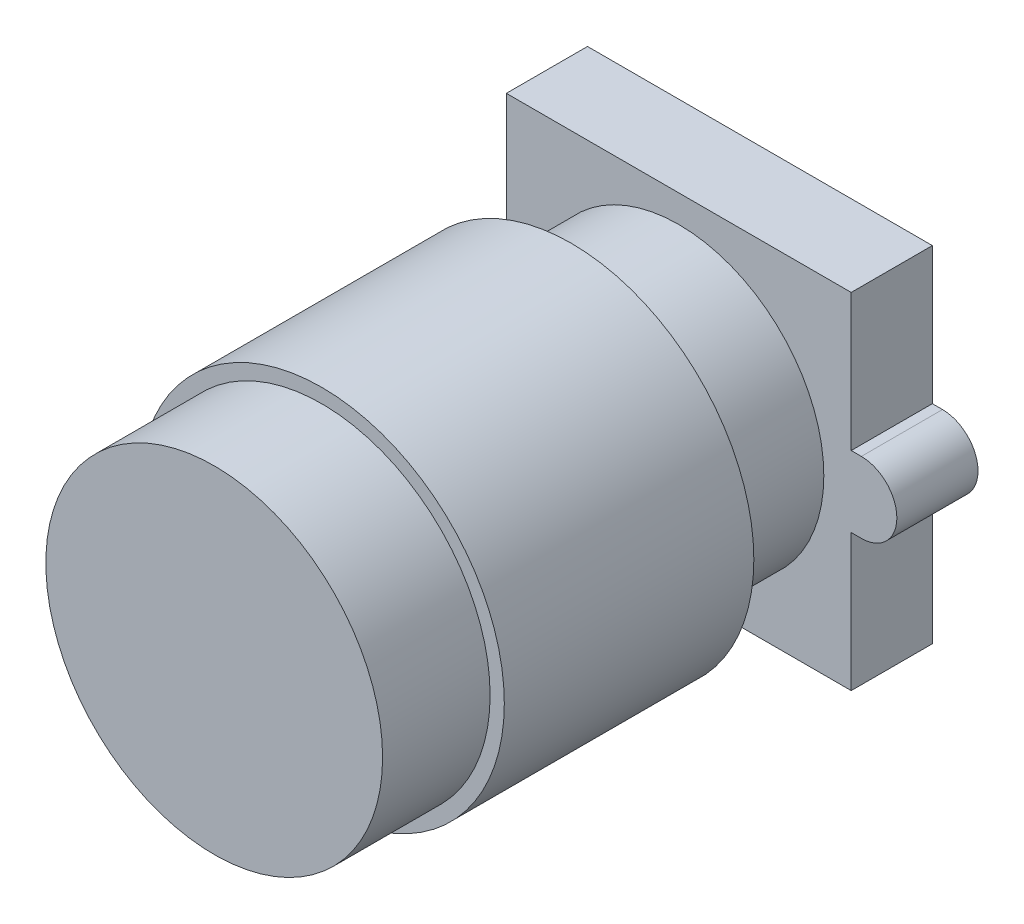
ISO-10303-21;
HEADER;
FILE_DESCRIPTION(('STEP AP214'),'2;1');
FILE_NAME('part.step','',(''),(''),'','','');
FILE_SCHEMA(('AUTOMOTIVE_DESIGN { 1 0 10303 214 1 1 1 1 }'));
ENDSEC;
DATA;
#1=APPLICATION_CONTEXT('core data for automotive mechanical design processes');
#2=APPLICATION_PROTOCOL_DEFINITION('international standard','automotive_design',2000,#1);
#3=PRODUCT_CONTEXT('',#1,'mechanical');
#4=PRODUCT('Part','Part','',(#3));
#5=PRODUCT_RELATED_PRODUCT_CATEGORY('part','',(#4));
#6=PRODUCT_DEFINITION_FORMATION('','',#4);
#7=PRODUCT_DEFINITION_CONTEXT('part definition',#1,'design');
#8=PRODUCT_DEFINITION('design','',#6,#7);
#9=PRODUCT_DEFINITION_SHAPE('','',#8);
#10=(LENGTH_UNIT() NAMED_UNIT(*) SI_UNIT(.MILLI.,.METRE.));
#11=(NAMED_UNIT(*) PLANE_ANGLE_UNIT() SI_UNIT($,.RADIAN.));
#12=(NAMED_UNIT(*) SI_UNIT($,.STERADIAN.) SOLID_ANGLE_UNIT());
#13=UNCERTAINTY_MEASURE_WITH_UNIT(LENGTH_MEASURE(1.E-05),#10,'distance_accuracy_value','');
#14=(GEOMETRIC_REPRESENTATION_CONTEXT(3) GLOBAL_UNCERTAINTY_ASSIGNED_CONTEXT((#13)) GLOBAL_UNIT_ASSIGNED_CONTEXT((#10,
#11,#12)) REPRESENTATION_CONTEXT('',''));
#15=CARTESIAN_POINT('',(0.,0.,0.));
#16=DIRECTION('',(0.,0.,1.));
#17=DIRECTION('',(1.,0.,0.));
#18=AXIS2_PLACEMENT_3D('',#15,#16,#17);
#19=CARTESIAN_POINT('',(-8.5,0.,4.));
#20=DIRECTION('',(-1.,0.,0.));
#21=DIRECTION('',(0.,0.,1.));
#22=AXIS2_PLACEMENT_3D('',#19,#20,#21);
#23=PLANE('',#22);
#24=DIRECTION('',(0.,1.,0.));
#25=VECTOR('',#24,1.);
#26=CARTESIAN_POINT('',(-8.5,0.,0.));
#27=LINE('',#26,#25);
#28=CARTESIAN_POINT('',(-8.5,1.75,0.));
#29=VERTEX_POINT('',#28);
#30=CARTESIAN_POINT('',(-8.5,8.5,0.));
#31=VERTEX_POINT('',#30);
#32=EDGE_CURVE('E157',#29,#31,#27,.T.);
#33=ORIENTED_EDGE('',*,*,#32,.F.);
#34=DIRECTION('',(0.,0.,-1.));
#35=VECTOR('',#34,1.);
#36=CARTESIAN_POINT('',(-8.5,1.75,4.));
#37=LINE('',#36,#35);
#38=CARTESIAN_POINT('',(-8.5,1.75,4.));
#39=VERTEX_POINT('',#38);
#40=EDGE_CURVE('E40',#39,#29,#37,.T.);
#41=ORIENTED_EDGE('',*,*,#40,.F.);
#42=DIRECTION('',(0.,1.,0.));
#43=VECTOR('',#42,1.);
#44=CARTESIAN_POINT('',(-8.5,0.,4.));
#45=LINE('',#44,#43);
#46=CARTESIAN_POINT('',(-8.5,8.5,4.));
#47=VERTEX_POINT('',#46);
#48=EDGE_CURVE('E186',#39,#47,#45,.T.);
#49=ORIENTED_EDGE('',*,*,#48,.T.);
#50=DIRECTION('',(0.,0.,-1.));
#51=VECTOR('',#50,1.);
#52=CARTESIAN_POINT('',(-8.5,8.5,4.));
#53=LINE('',#52,#51);
#54=EDGE_CURVE('E102',#47,#31,#53,.T.);
#55=ORIENTED_EDGE('',*,*,#54,.T.);
#56=EDGE_LOOP('',(#33,#41,#49,#55));
#57=FACE_BOUND('',#56,.T.);
#58=ADVANCED_FACE('F37',(#57),#23,.T.);
#59=CARTESIAN_POINT('',(0.,1.75,4.));
#60=DIRECTION('',(0.,1.,0.));
#61=DIRECTION('',(0.,0.,1.));
#62=AXIS2_PLACEMENT_3D('',#59,#60,#61);
#63=PLANE('',#62);
#64=DIRECTION('',(1.,0.,0.));
#65=VECTOR('',#64,1.);
#66=CARTESIAN_POINT('',(0.,1.75,0.));
#67=LINE('',#66,#65);
#68=CARTESIAN_POINT('',(-9.,1.75,0.));
#69=VERTEX_POINT('',#68);
#70=EDGE_CURVE('E160',#69,#29,#67,.T.);
#71=ORIENTED_EDGE('',*,*,#70,.F.);
#72=DIRECTION('',(0.,0.,-1.));
#73=VECTOR('',#72,1.);
#74=CARTESIAN_POINT('',(-9.,1.75,4.));
#75=LINE('',#74,#73);
#76=CARTESIAN_POINT('',(-9.,1.75,4.));
#77=VERTEX_POINT('',#76);
#78=EDGE_CURVE('E204',#77,#69,#75,.T.);
#79=ORIENTED_EDGE('',*,*,#78,.F.);
#80=DIRECTION('',(1.,0.,0.));
#81=VECTOR('',#80,1.);
#82=CARTESIAN_POINT('',(0.,1.75,4.));
#83=LINE('',#82,#81);
#84=EDGE_CURVE('E219',#77,#39,#83,.T.);
#85=ORIENTED_EDGE('',*,*,#84,.T.);
#86=ORIENTED_EDGE('',*,*,#40,.T.);
#87=EDGE_LOOP('',(#71,#79,#85,#86));
#88=FACE_BOUND('',#87,.T.);
#89=ADVANCED_FACE('F249',(#88),#63,.T.);
#90=CARTESIAN_POINT('',(-9.,0.,4.));
#91=DIRECTION('',(0.,0.,-1.));
#92=DIRECTION('',(-1.,0.,0.));
#93=AXIS2_PLACEMENT_3D('',#90,#91,#92);
#94=CYLINDRICAL_SURFACE('',#93,1.75);
#95=CARTESIAN_POINT('',(-9.,0.,0.));
#96=DIRECTION('',(0.,0.,1.));
#97=DIRECTION('',(1.,0.,0.));
#98=AXIS2_PLACEMENT_3D('',#95,#96,#97);
#99=CIRCLE('',#98,1.75);
#100=CARTESIAN_POINT('',(-9.,-1.75,0.));
#101=VERTEX_POINT('',#100);
#102=EDGE_CURVE('E164',#69,#101,#99,.T.);
#103=ORIENTED_EDGE('',*,*,#102,.T.);
#104=DIRECTION('',(0.,0.,-1.));
#105=VECTOR('',#104,1.);
#106=CARTESIAN_POINT('',(-9.,-1.75,4.));
#107=LINE('',#106,#105);
#108=CARTESIAN_POINT('',(-9.,-1.75,4.));
#109=VERTEX_POINT('',#108);
#110=EDGE_CURVE('E202',#109,#101,#107,.T.);
#111=ORIENTED_EDGE('',*,*,#110,.F.);
#112=CARTESIAN_POINT('',(-9.,0.,4.));
#113=DIRECTION('',(0.,0.,1.));
#114=DIRECTION('',(1.,0.,0.));
#115=AXIS2_PLACEMENT_3D('',#112,#113,#114);
#116=CIRCLE('',#115,1.75);
#117=EDGE_CURVE('E221',#77,#109,#116,.T.);
#118=ORIENTED_EDGE('',*,*,#117,.F.);
#119=ORIENTED_EDGE('',*,*,#78,.T.);
#120=EDGE_LOOP('',(#103,#111,#118,#119));
#121=FACE_BOUND('',#120,.T.);
#122=ADVANCED_FACE('F251',(#121),#94,.T.);
#123=CARTESIAN_POINT('',(0.,-1.75,4.));
#124=DIRECTION('',(0.,1.,0.));
#125=DIRECTION('',(0.,0.,1.));
#126=AXIS2_PLACEMENT_3D('',#123,#124,#125);
#127=PLANE('',#126);
#128=DIRECTION('',(1.,0.,0.));
#129=VECTOR('',#128,1.);
#130=CARTESIAN_POINT('',(0.,-1.75,0.));
#131=LINE('',#130,#129);
#132=CARTESIAN_POINT('',(-8.5,-1.75,0.));
#133=VERTEX_POINT('',#132);
#134=EDGE_CURVE('E166',#101,#133,#131,.T.);
#135=ORIENTED_EDGE('',*,*,#134,.T.);
#136=DIRECTION('',(0.,0.,-1.));
#137=VECTOR('',#136,1.);
#138=CARTESIAN_POINT('',(-8.5,-1.75,4.));
#139=LINE('',#138,#137);
#140=CARTESIAN_POINT('',(-8.5,-1.75,4.));
#141=VERTEX_POINT('',#140);
#142=EDGE_CURVE('E200',#141,#133,#139,.T.);
#143=ORIENTED_EDGE('',*,*,#142,.F.);
#144=DIRECTION('',(1.,0.,0.));
#145=VECTOR('',#144,1.);
#146=CARTESIAN_POINT('',(0.,-1.75,4.));
#147=LINE('',#146,#145);
#148=EDGE_CURVE('E223',#109,#141,#147,.T.);
#149=ORIENTED_EDGE('',*,*,#148,.F.);
#150=ORIENTED_EDGE('',*,*,#110,.T.);
#151=EDGE_LOOP('',(#135,#143,#149,#150));
#152=FACE_BOUND('',#151,.T.);
#153=ADVANCED_FACE('F256',(#152),#127,.F.);
#154=CARTESIAN_POINT('',(-8.5,0.,4.));
#155=DIRECTION('',(-1.,0.,0.));
#156=DIRECTION('',(0.,0.,1.));
#157=AXIS2_PLACEMENT_3D('',#154,#155,#156);
#158=PLANE('',#157);
#159=DIRECTION('',(0.,1.,0.));
#160=VECTOR('',#159,1.);
#161=CARTESIAN_POINT('',(-8.5,0.,0.));
#162=LINE('',#161,#160);
#163=CARTESIAN_POINT('',(-8.5,-8.5,0.));
#164=VERTEX_POINT('',#163);
#165=EDGE_CURVE('E169',#164,#133,#162,.T.);
#166=ORIENTED_EDGE('',*,*,#165,.F.);
#167=DIRECTION('',(0.,0.,-1.));
#168=VECTOR('',#167,1.);
#169=CARTESIAN_POINT('',(-8.5,-8.5,4.));
#170=LINE('',#169,#168);
#171=CARTESIAN_POINT('',(-8.5,-8.5,4.));
#172=VERTEX_POINT('',#171);
#173=EDGE_CURVE('E198',#172,#164,#170,.T.);
#174=ORIENTED_EDGE('',*,*,#173,.F.);
#175=DIRECTION('',(0.,1.,0.));
#176=VECTOR('',#175,1.);
#177=CARTESIAN_POINT('',(-8.5,0.,4.));
#178=LINE('',#177,#176);
#179=EDGE_CURVE('E225',#172,#141,#178,.T.);
#180=ORIENTED_EDGE('',*,*,#179,.T.);
#181=ORIENTED_EDGE('',*,*,#142,.T.);
#182=EDGE_LOOP('',(#166,#174,#180,#181));
#183=FACE_BOUND('',#182,.T.);
#184=ADVANCED_FACE('F260',(#183),#158,.T.);
#185=CARTESIAN_POINT('',(0.,-8.5,4.));
#186=DIRECTION('',(0.,-1.,0.));
#187=DIRECTION('',(1.,0.,0.));
#188=AXIS2_PLACEMENT_3D('',#185,#186,#187);
#189=PLANE('',#188);
#190=DIRECTION('',(-1.,0.,0.));
#191=VECTOR('',#190,1.);
#192=CARTESIAN_POINT('',(0.,-8.5,0.));
#193=LINE('',#192,#191);
#194=CARTESIAN_POINT('',(8.5,-8.5,0.));
#195=VERTEX_POINT('',#194);
#196=EDGE_CURVE('E172',#195,#164,#193,.T.);
#197=ORIENTED_EDGE('',*,*,#196,.F.);
#198=DIRECTION('',(0.,0.,-1.));
#199=VECTOR('',#198,1.);
#200=CARTESIAN_POINT('',(8.5,-8.5,4.));
#201=LINE('',#200,#199);
#202=CARTESIAN_POINT('',(8.5,-8.5,4.));
#203=VERTEX_POINT('',#202);
#204=EDGE_CURVE('E196',#203,#195,#201,.T.);
#205=ORIENTED_EDGE('',*,*,#204,.F.);
#206=DIRECTION('',(-1.,0.,0.));
#207=VECTOR('',#206,1.);
#208=CARTESIAN_POINT('',(0.,-8.5,4.));
#209=LINE('',#208,#207);
#210=EDGE_CURVE('E228',#203,#172,#209,.T.);
#211=ORIENTED_EDGE('',*,*,#210,.T.);
#212=ORIENTED_EDGE('',*,*,#173,.T.);
#213=EDGE_LOOP('',(#197,#205,#211,#212));
#214=FACE_BOUND('',#213,.T.);
#215=ADVANCED_FACE('F263',(#214),#189,.T.);
#216=CARTESIAN_POINT('',(8.5,0.,4.));
#217=DIRECTION('',(-1.,0.,0.));
#218=DIRECTION('',(0.,0.,1.));
#219=AXIS2_PLACEMENT_3D('',#216,#217,#218);
#220=PLANE('',#219);
#221=DIRECTION('',(0.,1.,0.));
#222=VECTOR('',#221,1.);
#223=CARTESIAN_POINT('',(8.5,0.,0.));
#224=LINE('',#223,#222);
#225=CARTESIAN_POINT('',(8.5,-1.75,0.));
#226=VERTEX_POINT('',#225);
#227=EDGE_CURVE('E175',#195,#226,#224,.T.);
#228=ORIENTED_EDGE('',*,*,#227,.T.);
#229=DIRECTION('',(0.,0.,-1.));
#230=VECTOR('',#229,1.);
#231=CARTESIAN_POINT('',(8.5,-1.75,4.));
#232=LINE('',#231,#230);
#233=CARTESIAN_POINT('',(8.5,-1.75,4.));
#234=VERTEX_POINT('',#233);
#235=EDGE_CURVE('E193',#234,#226,#232,.T.);
#236=ORIENTED_EDGE('',*,*,#235,.F.);
#237=DIRECTION('',(0.,1.,0.));
#238=VECTOR('',#237,1.);
#239=CARTESIAN_POINT('',(8.5,0.,4.));
#240=LINE('',#239,#238);
#241=EDGE_CURVE('E231',#203,#234,#240,.T.);
#242=ORIENTED_EDGE('',*,*,#241,.F.);
#243=ORIENTED_EDGE('',*,*,#204,.T.);
#244=EDGE_LOOP('',(#228,#236,#242,#243));
#245=FACE_BOUND('',#244,.T.);
#246=ADVANCED_FACE('F266',(#245),#220,.F.);
#247=CARTESIAN_POINT('',(0.,-1.75,4.));
#248=DIRECTION('',(0.,1.,0.));
#249=DIRECTION('',(0.,0.,1.));
#250=AXIS2_PLACEMENT_3D('',#247,#248,#249);
#251=PLANE('',#250);
#252=DIRECTION('',(1.,0.,0.));
#253=VECTOR('',#252,1.);
#254=CARTESIAN_POINT('',(0.,-1.75,0.));
#255=LINE('',#254,#253);
#256=CARTESIAN_POINT('',(9.,-1.75,0.));
#257=VERTEX_POINT('',#256);
#258=EDGE_CURVE('E177',#226,#257,#255,.T.);
#259=ORIENTED_EDGE('',*,*,#258,.T.);
#260=DIRECTION('',(0.,0.,-1.));
#261=VECTOR('',#260,1.);
#262=CARTESIAN_POINT('',(9.,-1.75,4.));
#263=LINE('',#262,#261);
#264=CARTESIAN_POINT('',(9.,-1.75,4.));
#265=VERTEX_POINT('',#264);
#266=EDGE_CURVE('E190',#265,#257,#263,.T.);
#267=ORIENTED_EDGE('',*,*,#266,.F.);
#268=DIRECTION('',(1.,0.,0.));
#269=VECTOR('',#268,1.);
#270=CARTESIAN_POINT('',(0.,-1.75,4.));
#271=LINE('',#270,#269);
#272=EDGE_CURVE('E152',#234,#265,#271,.T.);
#273=ORIENTED_EDGE('',*,*,#272,.F.);
#274=ORIENTED_EDGE('',*,*,#235,.T.);
#275=EDGE_LOOP('',(#259,#267,#273,#274));
#276=FACE_BOUND('',#275,.T.);
#277=ADVANCED_FACE('F238',(#276),#251,.F.);
#278=CARTESIAN_POINT('',(9.,0.,4.));
#279=DIRECTION('',(0.,0.,-1.));
#280=DIRECTION('',(-1.,0.,0.));
#281=AXIS2_PLACEMENT_3D('',#278,#279,#280);
#282=CYLINDRICAL_SURFACE('',#281,1.75);
#283=CARTESIAN_POINT('',(9.,0.,0.));
#284=DIRECTION('',(0.,0.,1.));
#285=DIRECTION('',(1.,0.,0.));
#286=AXIS2_PLACEMENT_3D('',#283,#284,#285);
#287=CIRCLE('',#286,1.75);
#288=CARTESIAN_POINT('',(9.,1.75,0.));
#289=VERTEX_POINT('',#288);
#290=EDGE_CURVE('E179',#257,#289,#287,.T.);
#291=ORIENTED_EDGE('',*,*,#290,.T.);
#292=DIRECTION('',(0.,0.,-1.));
#293=VECTOR('',#292,1.);
#294=CARTESIAN_POINT('',(9.,1.75,4.));
#295=LINE('',#294,#293);
#296=CARTESIAN_POINT('',(9.,1.75,4.));
#297=VERTEX_POINT('',#296);
#298=EDGE_CURVE('E141',#297,#289,#295,.T.);
#299=ORIENTED_EDGE('',*,*,#298,.F.);
#300=CARTESIAN_POINT('',(9.,0.,4.));
#301=DIRECTION('',(0.,0.,1.));
#302=DIRECTION('',(1.,0.,0.));
#303=AXIS2_PLACEMENT_3D('',#300,#301,#302);
#304=CIRCLE('',#303,1.75);
#305=EDGE_CURVE('E149',#265,#297,#304,.T.);
#306=ORIENTED_EDGE('',*,*,#305,.F.);
#307=ORIENTED_EDGE('',*,*,#266,.T.);
#308=EDGE_LOOP('',(#291,#299,#306,#307));
#309=FACE_BOUND('',#308,.T.);
#310=ADVANCED_FACE('F242',(#309),#282,.T.);
#311=CARTESIAN_POINT('',(0.,1.75,4.));
#312=DIRECTION('',(0.,1.,0.));
#313=DIRECTION('',(0.,0.,1.));
#314=AXIS2_PLACEMENT_3D('',#311,#312,#313);
#315=PLANE('',#314);
#316=DIRECTION('',(1.,0.,0.));
#317=VECTOR('',#316,1.);
#318=CARTESIAN_POINT('',(0.,1.75,0.));
#319=LINE('',#318,#317);
#320=CARTESIAN_POINT('',(8.5,1.75,0.));
#321=VERTEX_POINT('',#320);
#322=EDGE_CURVE('E140',#321,#289,#319,.T.);
#323=ORIENTED_EDGE('',*,*,#322,.F.);
#324=DIRECTION('',(0.,0.,-1.));
#325=VECTOR('',#324,1.);
#326=CARTESIAN_POINT('',(8.5,1.75,4.));
#327=LINE('',#326,#325);
#328=CARTESIAN_POINT('',(8.5,1.75,4.));
#329=VERTEX_POINT('',#328);
#330=EDGE_CURVE('E134',#329,#321,#327,.T.);
#331=ORIENTED_EDGE('',*,*,#330,.F.);
#332=DIRECTION('',(1.,0.,0.));
#333=VECTOR('',#332,1.);
#334=CARTESIAN_POINT('',(0.,1.75,4.));
#335=LINE('',#334,#333);
#336=EDGE_CURVE('E138',#329,#297,#335,.T.);
#337=ORIENTED_EDGE('',*,*,#336,.T.);
#338=ORIENTED_EDGE('',*,*,#298,.T.);
#339=EDGE_LOOP('',(#323,#331,#337,#338));
#340=FACE_BOUND('',#339,.T.);
#341=ADVANCED_FACE('F136',(#340),#315,.T.);
#342=CARTESIAN_POINT('',(8.5,0.,4.));
#343=DIRECTION('',(-1.,0.,0.));
#344=DIRECTION('',(0.,0.,1.));
#345=AXIS2_PLACEMENT_3D('',#342,#343,#344);
#346=PLANE('',#345);
#347=DIRECTION('',(0.,1.,0.));
#348=VECTOR('',#347,1.);
#349=CARTESIAN_POINT('',(8.5,0.,0.));
#350=LINE('',#349,#348);
#351=CARTESIAN_POINT('',(8.5,8.5,0.));
#352=VERTEX_POINT('',#351);
#353=EDGE_CURVE('E95',#321,#352,#350,.T.);
#354=ORIENTED_EDGE('',*,*,#353,.T.);
#355=DIRECTION('',(0.,0.,-1.));
#356=VECTOR('',#355,1.);
#357=CARTESIAN_POINT('',(8.5,8.5,4.));
#358=LINE('',#357,#356);
#359=CARTESIAN_POINT('',(8.5,8.5,4.));
#360=VERTEX_POINT('',#359);
#361=EDGE_CURVE('E142',#360,#352,#358,.T.);
#362=ORIENTED_EDGE('',*,*,#361,.F.);
#363=DIRECTION('',(0.,1.,0.));
#364=VECTOR('',#363,1.);
#365=CARTESIAN_POINT('',(8.5,0.,4.));
#366=LINE('',#365,#364);
#367=EDGE_CURVE('E144',#329,#360,#366,.T.);
#368=ORIENTED_EDGE('',*,*,#367,.F.);
#369=ORIENTED_EDGE('',*,*,#330,.T.);
#370=EDGE_LOOP('',(#354,#362,#368,#369));
#371=FACE_BOUND('',#370,.T.);
#372=ADVANCED_FACE('F145',(#371),#346,.F.);
#373=CARTESIAN_POINT('',(0.,8.5,4.));
#374=DIRECTION('',(0.,-1.,0.));
#375=DIRECTION('',(1.,0.,0.));
#376=AXIS2_PLACEMENT_3D('',#373,#374,#375);
#377=PLANE('',#376);
#378=DIRECTION('',(-1.,0.,0.));
#379=VECTOR('',#378,1.);
#380=CARTESIAN_POINT('',(0.,8.5,0.));
#381=LINE('',#380,#379);
#382=EDGE_CURVE('E184',#352,#31,#381,.T.);
#383=ORIENTED_EDGE('',*,*,#382,.T.);
#384=ORIENTED_EDGE('',*,*,#54,.F.);
#385=DIRECTION('',(-1.,0.,0.));
#386=VECTOR('',#385,1.);
#387=CARTESIAN_POINT('',(0.,8.5,4.));
#388=LINE('',#387,#386);
#389=EDGE_CURVE('E55',#360,#47,#388,.T.);
#390=ORIENTED_EDGE('',*,*,#389,.F.);
#391=ORIENTED_EDGE('',*,*,#361,.T.);
#392=EDGE_LOOP('',(#383,#384,#390,#391));
#393=FACE_BOUND('',#392,.T.);
#394=ADVANCED_FACE('F247',(#393),#377,.F.);
#395=CARTESIAN_POINT('',(0.,0.,4.));
#396=DIRECTION('',(0.,0.,1.));
#397=DIRECTION('',(1.,0.,0.));
#398=AXIS2_PLACEMENT_3D('',#395,#396,#397);
#399=PLANE('',#398);
#400=CARTESIAN_POINT('',(0.,0.,4.));
#401=DIRECTION('',(0.,0.,1.));
#402=DIRECTION('',(1.,0.,0.));
#403=AXIS2_PLACEMENT_3D('',#400,#401,#402);
#404=CIRCLE('',#403,7.15);
#405=CARTESIAN_POINT('',(7.15,0.,4.));
#406=VERTEX_POINT('',#405);
#407=EDGE_CURVE('E46',#406,#406,#404,.T.);
#408=ORIENTED_EDGE('',*,*,#407,.F.);
#409=EDGE_LOOP('',(#408));
#410=FACE_BOUND('',#409,.T.);
#411=ORIENTED_EDGE('',*,*,#48,.F.);
#412=ORIENTED_EDGE('',*,*,#84,.F.);
#413=ORIENTED_EDGE('',*,*,#117,.T.);
#414=ORIENTED_EDGE('',*,*,#148,.T.);
#415=ORIENTED_EDGE('',*,*,#179,.F.);
#416=ORIENTED_EDGE('',*,*,#210,.F.);
#417=ORIENTED_EDGE('',*,*,#241,.T.);
#418=ORIENTED_EDGE('',*,*,#272,.T.);
#419=ORIENTED_EDGE('',*,*,#305,.T.);
#420=ORIENTED_EDGE('',*,*,#336,.F.);
#421=ORIENTED_EDGE('',*,*,#367,.T.);
#422=ORIENTED_EDGE('',*,*,#389,.T.);
#423=EDGE_LOOP('',(#411,#412,#413,#414,#415,#416,#417,#418,#419,#420,#421,#422));
#424=FACE_BOUND('',#423,.T.);
#425=ADVANCED_FACE('F147',(#410,#424),#399,.T.);
#426=CARTESIAN_POINT('',(0.,0.,0.));
#427=DIRECTION('',(0.,0.,1.));
#428=DIRECTION('',(1.,0.,0.));
#429=AXIS2_PLACEMENT_3D('',#426,#427,#428);
#430=PLANE('',#429);
#431=ORIENTED_EDGE('',*,*,#32,.T.);
#432=ORIENTED_EDGE('',*,*,#382,.F.);
#433=ORIENTED_EDGE('',*,*,#353,.F.);
#434=ORIENTED_EDGE('',*,*,#322,.T.);
#435=ORIENTED_EDGE('',*,*,#290,.F.);
#436=ORIENTED_EDGE('',*,*,#258,.F.);
#437=ORIENTED_EDGE('',*,*,#227,.F.);
#438=ORIENTED_EDGE('',*,*,#196,.T.);
#439=ORIENTED_EDGE('',*,*,#165,.T.);
#440=ORIENTED_EDGE('',*,*,#134,.F.);
#441=ORIENTED_EDGE('',*,*,#102,.F.);
#442=ORIENTED_EDGE('',*,*,#70,.T.);
#443=EDGE_LOOP('',(#431,#432,#433,#434,#435,#436,#437,#438,#439,#440,#441,#442));
#444=FACE_BOUND('',#443,.T.);
#445=ADVANCED_FACE('F244',(#444),#430,.F.);
#446=CARTESIAN_POINT('',(0.,0.,9.3));
#447=DIRECTION('',(0.,0.,-1.));
#448=DIRECTION('',(-1.,0.,0.));
#449=AXIS2_PLACEMENT_3D('',#446,#447,#448);
#450=CYLINDRICAL_SURFACE('',#449,7.15);
#451=CARTESIAN_POINT('',(0.,0.,9.3));
#452=DIRECTION('',(0.,0.,1.));
#453=DIRECTION('',(1.,0.,0.));
#454=AXIS2_PLACEMENT_3D('',#451,#452,#453);
#455=CIRCLE('',#454,7.15);
#456=CARTESIAN_POINT('',(7.15,0.,9.3));
#457=VERTEX_POINT('',#456);
#458=EDGE_CURVE('E161',#457,#457,#455,.T.);
#459=ORIENTED_EDGE('',*,*,#458,.F.);
#460=EDGE_LOOP('',(#459));
#461=FACE_BOUND('',#460,.T.);
#462=ORIENTED_EDGE('',*,*,#407,.T.);
#463=EDGE_LOOP('',(#462));
#464=FACE_BOUND('',#463,.T.);
#465=ADVANCED_FACE('F348',(#461,#464),#450,.T.);
#466=CARTESIAN_POINT('',(0.,0.,21.6));
#467=DIRECTION('',(0.,0.,-1.));
#468=DIRECTION('',(-1.,0.,0.));
#469=AXIS2_PLACEMENT_3D('',#466,#467,#468);
#470=CYLINDRICAL_SURFACE('',#469,9.);
#471=CARTESIAN_POINT('',(0.,0.,21.6));
#472=DIRECTION('',(0.,0.,1.));
#473=DIRECTION('',(1.,0.,0.));
#474=AXIS2_PLACEMENT_3D('',#471,#472,#473);
#475=CIRCLE('',#474,9.);
#476=CARTESIAN_POINT('',(9.,0.,21.6));
#477=VERTEX_POINT('',#476);
#478=EDGE_CURVE('E428',#477,#477,#475,.T.);
#479=ORIENTED_EDGE('',*,*,#478,.F.);
#480=EDGE_LOOP('',(#479));
#481=FACE_BOUND('',#480,.T.);
#482=CARTESIAN_POINT('',(0.,0.,9.3));
#483=DIRECTION('',(0.,0.,1.));
#484=DIRECTION('',(1.,0.,0.));
#485=AXIS2_PLACEMENT_3D('',#482,#483,#484);
#486=CIRCLE('',#485,9.);
#487=CARTESIAN_POINT('',(9.,0.,9.3));
#488=VERTEX_POINT('',#487);
#489=EDGE_CURVE('E425',#488,#488,#486,.T.);
#490=ORIENTED_EDGE('',*,*,#489,.T.);
#491=EDGE_LOOP('',(#490));
#492=FACE_BOUND('',#491,.T.);
#493=ADVANCED_FACE('F368',(#481,#492),#470,.T.);
#494=CARTESIAN_POINT('',(0.,0.,21.6));
#495=DIRECTION('',(0.,0.,1.));
#496=DIRECTION('',(1.,0.,0.));
#497=AXIS2_PLACEMENT_3D('',#494,#495,#496);
#498=PLANE('',#497);
#499=CARTESIAN_POINT('',(0.,0.,21.6));
#500=DIRECTION('',(0.,0.,1.));
#501=DIRECTION('',(1.,0.,0.));
#502=AXIS2_PLACEMENT_3D('',#499,#500,#501);
#503=CIRCLE('',#502,8.3);
#504=CARTESIAN_POINT('',(8.3,0.,21.6));
#505=VERTEX_POINT('',#504);
#506=EDGE_CURVE('E11',#505,#505,#503,.T.);
#507=ORIENTED_EDGE('',*,*,#506,.F.);
#508=EDGE_LOOP('',(#507));
#509=FACE_BOUND('',#508,.T.);
#510=ORIENTED_EDGE('',*,*,#478,.T.);
#511=EDGE_LOOP('',(#510));
#512=FACE_BOUND('',#511,.T.);
#513=ADVANCED_FACE('F378',(#509,#512),#498,.T.);
#514=CARTESIAN_POINT('',(0.,0.,9.3));
#515=DIRECTION('',(0.,0.,1.));
#516=DIRECTION('',(1.,0.,0.));
#517=AXIS2_PLACEMENT_3D('',#514,#515,#516);
#518=PLANE('',#517);
#519=ORIENTED_EDGE('',*,*,#458,.T.);
#520=EDGE_LOOP('',(#519));
#521=FACE_BOUND('',#520,.T.);
#522=ORIENTED_EDGE('',*,*,#489,.F.);
#523=EDGE_LOOP('',(#522));
#524=FACE_BOUND('',#523,.T.);
#525=ADVANCED_FACE('F386',(#521,#524),#518,.F.);
#526=CARTESIAN_POINT('',(0.,0.,26.9));
#527=DIRECTION('',(0.,0.,-1.));
#528=DIRECTION('',(-1.,0.,0.));
#529=AXIS2_PLACEMENT_3D('',#526,#527,#528);
#530=CYLINDRICAL_SURFACE('',#529,8.3);
#531=CARTESIAN_POINT('',(0.,0.,26.9));
#532=DIRECTION('',(0.,0.,1.));
#533=DIRECTION('',(1.,0.,0.));
#534=AXIS2_PLACEMENT_3D('',#531,#532,#533);
#535=CIRCLE('',#534,8.3);
#536=CARTESIAN_POINT('',(8.3,0.,26.9));
#537=VERTEX_POINT('',#536);
#538=EDGE_CURVE('E424',#537,#537,#535,.T.);
#539=ORIENTED_EDGE('',*,*,#538,.F.);
#540=EDGE_LOOP('',(#539));
#541=FACE_BOUND('',#540,.T.);
#542=ORIENTED_EDGE('',*,*,#506,.T.);
#543=EDGE_LOOP('',(#542));
#544=FACE_BOUND('',#543,.T.);
#545=ADVANCED_FACE('F391',(#541,#544),#530,.T.);
#546=CARTESIAN_POINT('',(0.,0.,26.9));
#547=DIRECTION('',(0.,0.,1.));
#548=DIRECTION('',(1.,0.,0.));
#549=AXIS2_PLACEMENT_3D('',#546,#547,#548);
#550=PLANE('',#549);
#551=ORIENTED_EDGE('',*,*,#538,.T.);
#552=EDGE_LOOP('',(#551));
#553=FACE_BOUND('',#552,.T.);
#554=ADVANCED_FACE('F408',(#553),#550,.T.);
#555=CLOSED_SHELL('',(#58,#89,#122,#153,#184,#215,#246,#277,#310,#341,#372,#394,#425,#445,#465,
#493,#513,#525,#545,#554));
#556=MANIFOLD_SOLID_BREP('B2',#555);
#557=ADVANCED_BREP_SHAPE_REPRESENTATION('',(#18,#556),#14);
#558=SHAPE_DEFINITION_REPRESENTATION(#9,#557);
ENDSEC;
END-ISO-10303-21;
